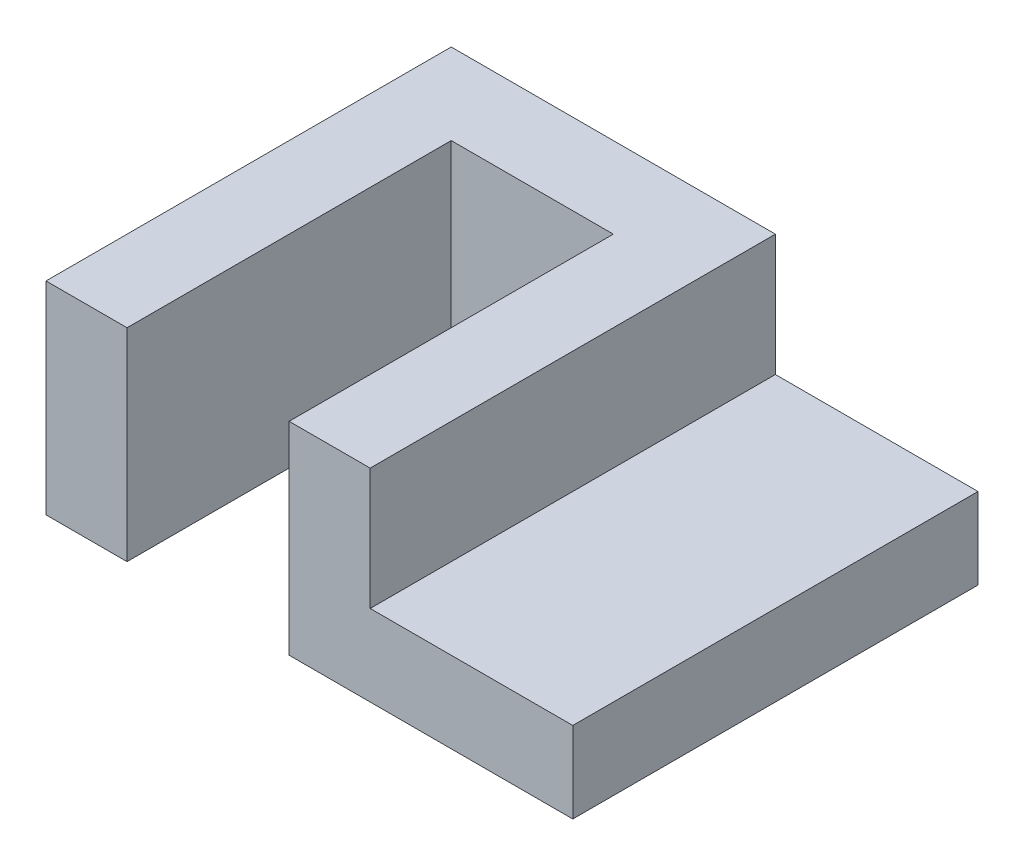
ISO-10303-21;
HEADER;
FILE_DESCRIPTION(('STEP AP214'),'2;1');
FILE_NAME('part.step','',(''),(''),'','','');
FILE_SCHEMA(('AUTOMOTIVE_DESIGN { 1 0 10303 214 1 1 1 1 }'));
ENDSEC;
DATA;
#1=APPLICATION_CONTEXT('core data for automotive mechanical design processes');
#2=APPLICATION_PROTOCOL_DEFINITION('international standard','automotive_design',2000,#1);
#3=PRODUCT_CONTEXT('',#1,'mechanical');
#4=PRODUCT('Part','Part','',(#3));
#5=PRODUCT_RELATED_PRODUCT_CATEGORY('part','',(#4));
#6=PRODUCT_DEFINITION_FORMATION('','',#4);
#7=PRODUCT_DEFINITION_CONTEXT('part definition',#1,'design');
#8=PRODUCT_DEFINITION('design','',#6,#7);
#9=PRODUCT_DEFINITION_SHAPE('','',#8);
#10=(LENGTH_UNIT() NAMED_UNIT(*) SI_UNIT(.MILLI.,.METRE.));
#11=(NAMED_UNIT(*) PLANE_ANGLE_UNIT() SI_UNIT($,.RADIAN.));
#12=(NAMED_UNIT(*) SI_UNIT($,.STERADIAN.) SOLID_ANGLE_UNIT());
#13=UNCERTAINTY_MEASURE_WITH_UNIT(LENGTH_MEASURE(1.E-05),#10,'distance_accuracy_value','');
#14=(GEOMETRIC_REPRESENTATION_CONTEXT(3) GLOBAL_UNCERTAINTY_ASSIGNED_CONTEXT((#13)) GLOBAL_UNIT_ASSIGNED_CONTEXT((#10,
#11,#12)) REPRESENTATION_CONTEXT('',''));
#15=CARTESIAN_POINT('',(0.,0.,0.));
#16=DIRECTION('',(0.,0.,1.));
#17=DIRECTION('',(1.,0.,0.));
#18=AXIS2_PLACEMENT_3D('',#15,#16,#17);
#19=CARTESIAN_POINT('',(80.,50.,-100.));
#20=DIRECTION('',(-1.,0.,0.));
#21=DIRECTION('',(0.,0.,1.));
#22=AXIS2_PLACEMENT_3D('',#19,#20,#21);
#23=PLANE('',#22);
#24=DIRECTION('',(0.,0.,1.));
#25=VECTOR('',#24,1.);
#26=CARTESIAN_POINT('',(80.,20.,0.));
#27=LINE('',#26,#25);
#28=CARTESIAN_POINT('',(80.,20.,-100.));
#29=VERTEX_POINT('',#28);
#30=CARTESIAN_POINT('',(80.,20.,0.));
#31=VERTEX_POINT('',#30);
#32=EDGE_CURVE('E59',#29,#31,#27,.T.);
#33=ORIENTED_EDGE('',*,*,#32,.F.);
#34=DIRECTION('',(0.,-1.,0.));
#35=VECTOR('',#34,1.);
#36=CARTESIAN_POINT('',(80.,50.,-100.));
#37=LINE('',#36,#35);
#38=CARTESIAN_POINT('',(80.,50.,-100.));
#39=VERTEX_POINT('',#38);
#40=EDGE_CURVE('E129',#39,#29,#37,.T.);
#41=ORIENTED_EDGE('',*,*,#40,.F.);
#42=DIRECTION('',(0.,0.,-1.));
#43=VECTOR('',#42,1.);
#44=CARTESIAN_POINT('',(80.,50.,-100.));
#45=LINE('',#44,#43);
#46=CARTESIAN_POINT('',(80.,50.,0.));
#47=VERTEX_POINT('',#46);
#48=EDGE_CURVE('E119',#47,#39,#45,.T.);
#49=ORIENTED_EDGE('',*,*,#48,.F.);
#50=DIRECTION('',(0.,-1.,0.));
#51=VECTOR('',#50,1.);
#52=CARTESIAN_POINT('',(80.,50.,0.));
#53=LINE('',#52,#51);
#54=EDGE_CURVE('E134',#47,#31,#53,.T.);
#55=ORIENTED_EDGE('',*,*,#54,.T.);
#56=EDGE_LOOP('',(#33,#41,#49,#55));
#57=FACE_BOUND('',#56,.T.);
#58=ADVANCED_FACE('F43',(#57),#23,.F.);
#59=CARTESIAN_POINT('',(20.,50.,0.));
#60=DIRECTION('',(0.,0.,-1.));
#61=DIRECTION('',(-1.,0.,0.));
#62=AXIS2_PLACEMENT_3D('',#59,#60,#61);
#63=PLANE('',#62);
#64=DIRECTION('',(1.,0.,0.));
#65=VECTOR('',#64,1.);
#66=CARTESIAN_POINT('',(20.,0.,0.));
#67=LINE('',#66,#65);
#68=CARTESIAN_POINT('',(0.,0.,0.));
#69=VERTEX_POINT('',#68);
#70=CARTESIAN_POINT('',(20.,0.,0.));
#71=VERTEX_POINT('',#70);
#72=EDGE_CURVE('E145',#69,#71,#67,.T.);
#73=ORIENTED_EDGE('',*,*,#72,.T.);
#74=DIRECTION('',(0.,-1.,0.));
#75=VECTOR('',#74,1.);
#76=CARTESIAN_POINT('',(20.,50.,0.));
#77=LINE('',#76,#75);
#78=CARTESIAN_POINT('',(20.,50.,0.));
#79=VERTEX_POINT('',#78);
#80=EDGE_CURVE('E11',#79,#71,#77,.T.);
#81=ORIENTED_EDGE('',*,*,#80,.F.);
#82=DIRECTION('',(1.,0.,0.));
#83=VECTOR('',#82,1.);
#84=CARTESIAN_POINT('',(20.,50.,0.));
#85=LINE('',#84,#83);
#86=CARTESIAN_POINT('',(0.,50.,0.));
#87=VERTEX_POINT('',#86);
#88=EDGE_CURVE('E168',#87,#79,#85,.T.);
#89=ORIENTED_EDGE('',*,*,#88,.F.);
#90=DIRECTION('',(0.,-1.,0.));
#91=VECTOR('',#90,1.);
#92=CARTESIAN_POINT('',(0.,50.,0.));
#93=LINE('',#92,#91);
#94=EDGE_CURVE('E141',#87,#69,#93,.T.);
#95=ORIENTED_EDGE('',*,*,#94,.T.);
#96=EDGE_LOOP('',(#73,#81,#89,#95));
#97=FACE_BOUND('',#96,.T.);
#98=ADVANCED_FACE('F45',(#97),#63,.F.);
#99=CARTESIAN_POINT('',(20.,50.,-80.));
#100=DIRECTION('',(-1.,0.,0.));
#101=DIRECTION('',(0.,0.,1.));
#102=AXIS2_PLACEMENT_3D('',#99,#100,#101);
#103=PLANE('',#102);
#104=DIRECTION('',(0.,0.,-1.));
#105=VECTOR('',#104,1.);
#106=CARTESIAN_POINT('',(20.,0.,-80.));
#107=LINE('',#106,#105);
#108=CARTESIAN_POINT('',(20.,0.,-80.));
#109=VERTEX_POINT('',#108);
#110=EDGE_CURVE('E149',#71,#109,#107,.T.);
#111=ORIENTED_EDGE('',*,*,#110,.T.);
#112=DIRECTION('',(0.,-1.,0.));
#113=VECTOR('',#112,1.);
#114=CARTESIAN_POINT('',(20.,50.,-80.));
#115=LINE('',#114,#113);
#116=CARTESIAN_POINT('',(20.,50.,-80.));
#117=VERTEX_POINT('',#116);
#118=EDGE_CURVE('E52',#117,#109,#115,.T.);
#119=ORIENTED_EDGE('',*,*,#118,.F.);
#120=DIRECTION('',(0.,0.,-1.));
#121=VECTOR('',#120,1.);
#122=CARTESIAN_POINT('',(20.,50.,-80.));
#123=LINE('',#122,#121);
#124=EDGE_CURVE('E103',#79,#117,#123,.T.);
#125=ORIENTED_EDGE('',*,*,#124,.F.);
#126=ORIENTED_EDGE('',*,*,#80,.T.);
#127=EDGE_LOOP('',(#111,#119,#125,#126));
#128=FACE_BOUND('',#127,.T.);
#129=ADVANCED_FACE('F253',(#128),#103,.F.);
#130=CARTESIAN_POINT('',(60.,50.,-80.));
#131=DIRECTION('',(0.,0.,-1.));
#132=DIRECTION('',(-1.,0.,0.));
#133=AXIS2_PLACEMENT_3D('',#130,#131,#132);
#134=PLANE('',#133);
#135=DIRECTION('',(1.,0.,0.));
#136=VECTOR('',#135,1.);
#137=CARTESIAN_POINT('',(60.,0.,-80.));
#138=LINE('',#137,#136);
#139=CARTESIAN_POINT('',(60.,0.,-80.));
#140=VERTEX_POINT('',#139);
#141=EDGE_CURVE('E153',#109,#140,#138,.T.);
#142=ORIENTED_EDGE('',*,*,#141,.T.);
#143=DIRECTION('',(0.,-1.,0.));
#144=VECTOR('',#143,1.);
#145=CARTESIAN_POINT('',(60.,50.,-80.));
#146=LINE('',#145,#144);
#147=CARTESIAN_POINT('',(60.,50.,-80.));
#148=VERTEX_POINT('',#147);
#149=EDGE_CURVE('E179',#148,#140,#146,.T.);
#150=ORIENTED_EDGE('',*,*,#149,.F.);
#151=DIRECTION('',(1.,0.,0.));
#152=VECTOR('',#151,1.);
#153=CARTESIAN_POINT('',(60.,50.,-80.));
#154=LINE('',#153,#152);
#155=EDGE_CURVE('E189',#117,#148,#154,.T.);
#156=ORIENTED_EDGE('',*,*,#155,.F.);
#157=ORIENTED_EDGE('',*,*,#118,.T.);
#158=EDGE_LOOP('',(#142,#150,#156,#157));
#159=FACE_BOUND('',#158,.T.);
#160=ADVANCED_FACE('F187',(#159),#134,.F.);
#161=CARTESIAN_POINT('',(60.,50.,0.));
#162=DIRECTION('',(1.,0.,0.));
#163=DIRECTION('',(0.,0.,-1.));
#164=AXIS2_PLACEMENT_3D('',#161,#162,#163);
#165=PLANE('',#164);
#166=DIRECTION('',(0.,0.,1.));
#167=VECTOR('',#166,1.);
#168=CARTESIAN_POINT('',(60.,0.,0.));
#169=LINE('',#168,#167);
#170=CARTESIAN_POINT('',(60.,0.,0.));
#171=VERTEX_POINT('',#170);
#172=EDGE_CURVE('E156',#140,#171,#169,.T.);
#173=ORIENTED_EDGE('',*,*,#172,.T.);
#174=DIRECTION('',(0.,-1.,0.));
#175=VECTOR('',#174,1.);
#176=CARTESIAN_POINT('',(60.,50.,0.));
#177=LINE('',#176,#175);
#178=CARTESIAN_POINT('',(60.,50.,0.));
#179=VERTEX_POINT('',#178);
#180=EDGE_CURVE('E175',#179,#171,#177,.T.);
#181=ORIENTED_EDGE('',*,*,#180,.F.);
#182=DIRECTION('',(0.,0.,1.));
#183=VECTOR('',#182,1.);
#184=CARTESIAN_POINT('',(60.,50.,0.));
#185=LINE('',#184,#183);
#186=EDGE_CURVE('E206',#148,#179,#185,.T.);
#187=ORIENTED_EDGE('',*,*,#186,.F.);
#188=ORIENTED_EDGE('',*,*,#149,.T.);
#189=EDGE_LOOP('',(#173,#181,#187,#188));
#190=FACE_BOUND('',#189,.T.);
#191=ADVANCED_FACE('F198',(#190),#165,.F.);
#192=CARTESIAN_POINT('',(80.,50.,0.));
#193=DIRECTION('',(0.,0.,-1.));
#194=DIRECTION('',(-1.,0.,0.));
#195=AXIS2_PLACEMENT_3D('',#192,#193,#194);
#196=PLANE('',#195);
#197=DIRECTION('',(1.,0.,0.));
#198=VECTOR('',#197,1.);
#199=CARTESIAN_POINT('',(80.,0.,0.));
#200=LINE('',#199,#198);
#201=CARTESIAN_POINT('',(130.,0.,0.));
#202=VERTEX_POINT('',#201);
#203=EDGE_CURVE('E159',#171,#202,#200,.T.);
#204=ORIENTED_EDGE('',*,*,#203,.T.);
#205=DIRECTION('',(0.,-1.,0.));
#206=VECTOR('',#205,1.);
#207=CARTESIAN_POINT('',(130.,0.,0.));
#208=LINE('',#207,#206);
#209=CARTESIAN_POINT('',(130.,20.,0.));
#210=VERTEX_POINT('',#209);
#211=EDGE_CURVE('E224',#210,#202,#208,.T.);
#212=ORIENTED_EDGE('',*,*,#211,.F.);
#213=DIRECTION('',(-1.,0.,0.));
#214=VECTOR('',#213,1.);
#215=CARTESIAN_POINT('',(130.,20.,0.));
#216=LINE('',#215,#214);
#217=EDGE_CURVE('E218',#210,#31,#216,.T.);
#218=ORIENTED_EDGE('',*,*,#217,.T.);
#219=ORIENTED_EDGE('',*,*,#54,.F.);
#220=DIRECTION('',(1.,0.,0.));
#221=VECTOR('',#220,1.);
#222=CARTESIAN_POINT('',(80.,50.,0.));
#223=LINE('',#222,#221);
#224=EDGE_CURVE('E125',#179,#47,#223,.T.);
#225=ORIENTED_EDGE('',*,*,#224,.F.);
#226=ORIENTED_EDGE('',*,*,#180,.T.);
#227=EDGE_LOOP('',(#204,#212,#218,#219,#225,#226));
#228=FACE_BOUND('',#227,.T.);
#229=ADVANCED_FACE('F201',(#228),#196,.F.);
#230=CARTESIAN_POINT('',(0.,50.,-100.));
#231=DIRECTION('',(0.,0.,1.));
#232=DIRECTION('',(1.,0.,0.));
#233=AXIS2_PLACEMENT_3D('',#230,#231,#232);
#234=PLANE('',#233);
#235=DIRECTION('',(-1.,0.,0.));
#236=VECTOR('',#235,1.);
#237=CARTESIAN_POINT('',(0.,0.,-100.));
#238=LINE('',#237,#236);
#239=CARTESIAN_POINT('',(130.,0.,-100.));
#240=VERTEX_POINT('',#239);
#241=CARTESIAN_POINT('',(0.,0.,-100.));
#242=VERTEX_POINT('',#241);
#243=EDGE_CURVE('E163',#240,#242,#238,.T.);
#244=ORIENTED_EDGE('',*,*,#243,.T.);
#245=DIRECTION('',(0.,-1.,0.));
#246=VECTOR('',#245,1.);
#247=CARTESIAN_POINT('',(0.,50.,-100.));
#248=LINE('',#247,#246);
#249=CARTESIAN_POINT('',(0.,50.,-100.));
#250=VERTEX_POINT('',#249);
#251=EDGE_CURVE('E135',#250,#242,#248,.T.);
#252=ORIENTED_EDGE('',*,*,#251,.F.);
#253=DIRECTION('',(-1.,0.,0.));
#254=VECTOR('',#253,1.);
#255=CARTESIAN_POINT('',(0.,50.,-100.));
#256=LINE('',#255,#254);
#257=EDGE_CURVE('E122',#39,#250,#256,.T.);
#258=ORIENTED_EDGE('',*,*,#257,.F.);
#259=ORIENTED_EDGE('',*,*,#40,.T.);
#260=DIRECTION('',(-1.,0.,0.));
#261=VECTOR('',#260,1.);
#262=CARTESIAN_POINT('',(130.,20.,-100.));
#263=LINE('',#262,#261);
#264=CARTESIAN_POINT('',(130.,20.,-100.));
#265=VERTEX_POINT('',#264);
#266=EDGE_CURVE('E150',#265,#29,#263,.T.);
#267=ORIENTED_EDGE('',*,*,#266,.F.);
#268=DIRECTION('',(0.,1.,0.));
#269=VECTOR('',#268,1.);
#270=CARTESIAN_POINT('',(130.,0.,-100.));
#271=LINE('',#270,#269);
#272=EDGE_CURVE('E228',#240,#265,#271,.T.);
#273=ORIENTED_EDGE('',*,*,#272,.F.);
#274=EDGE_LOOP('',(#244,#252,#258,#259,#267,#273));
#275=FACE_BOUND('',#274,.T.);
#276=ADVANCED_FACE('F137',(#275),#234,.F.);
#277=CARTESIAN_POINT('',(0.,50.,0.));
#278=DIRECTION('',(1.,0.,0.));
#279=DIRECTION('',(0.,0.,-1.));
#280=AXIS2_PLACEMENT_3D('',#277,#278,#279);
#281=PLANE('',#280);
#282=DIRECTION('',(0.,0.,1.));
#283=VECTOR('',#282,1.);
#284=CARTESIAN_POINT('',(0.,0.,0.));
#285=LINE('',#284,#283);
#286=EDGE_CURVE('E95',#242,#69,#285,.T.);
#287=ORIENTED_EDGE('',*,*,#286,.T.);
#288=ORIENTED_EDGE('',*,*,#94,.F.);
#289=DIRECTION('',(0.,0.,1.));
#290=VECTOR('',#289,1.);
#291=CARTESIAN_POINT('',(0.,50.,0.));
#292=LINE('',#291,#290);
#293=EDGE_CURVE('E68',#250,#87,#292,.T.);
#294=ORIENTED_EDGE('',*,*,#293,.F.);
#295=ORIENTED_EDGE('',*,*,#251,.T.);
#296=EDGE_LOOP('',(#287,#288,#294,#295));
#297=FACE_BOUND('',#296,.T.);
#298=ADVANCED_FACE('F249',(#297),#281,.F.);
#299=CARTESIAN_POINT('',(0.,50.,0.));
#300=DIRECTION('',(0.,-1.,0.));
#301=DIRECTION('',(0.,0.,-1.));
#302=AXIS2_PLACEMENT_3D('',#299,#300,#301);
#303=PLANE('',#302);
#304=ORIENTED_EDGE('',*,*,#88,.T.);
#305=ORIENTED_EDGE('',*,*,#124,.T.);
#306=ORIENTED_EDGE('',*,*,#155,.T.);
#307=ORIENTED_EDGE('',*,*,#186,.T.);
#308=ORIENTED_EDGE('',*,*,#224,.T.);
#309=ORIENTED_EDGE('',*,*,#48,.T.);
#310=ORIENTED_EDGE('',*,*,#257,.T.);
#311=ORIENTED_EDGE('',*,*,#293,.T.);
#312=EDGE_LOOP('',(#304,#305,#306,#307,#308,#309,#310,#311));
#313=FACE_BOUND('',#312,.T.);
#314=ADVANCED_FACE('F120',(#313),#303,.F.);
#315=CARTESIAN_POINT('',(0.,0.,0.));
#316=DIRECTION('',(0.,-1.,0.));
#317=DIRECTION('',(0.,0.,-1.));
#318=AXIS2_PLACEMENT_3D('',#315,#316,#317);
#319=PLANE('',#318);
#320=ORIENTED_EDGE('',*,*,#72,.F.);
#321=ORIENTED_EDGE('',*,*,#286,.F.);
#322=ORIENTED_EDGE('',*,*,#243,.F.);
#323=DIRECTION('',(0.,0.,-1.));
#324=VECTOR('',#323,1.);
#325=CARTESIAN_POINT('',(130.,0.,0.));
#326=LINE('',#325,#324);
#327=EDGE_CURVE('E232',#202,#240,#326,.T.);
#328=ORIENTED_EDGE('',*,*,#327,.F.);
#329=ORIENTED_EDGE('',*,*,#203,.F.);
#330=ORIENTED_EDGE('',*,*,#172,.F.);
#331=ORIENTED_EDGE('',*,*,#141,.F.);
#332=ORIENTED_EDGE('',*,*,#110,.F.);
#333=EDGE_LOOP('',(#320,#321,#322,#328,#329,#330,#331,#332));
#334=FACE_BOUND('',#333,.T.);
#335=ADVANCED_FACE('F193',(#334),#319,.T.);
#336=CARTESIAN_POINT('',(130.,20.,0.));
#337=DIRECTION('',(0.,-1.,0.));
#338=DIRECTION('',(0.,0.,-1.));
#339=AXIS2_PLACEMENT_3D('',#336,#337,#338);
#340=PLANE('',#339);
#341=ORIENTED_EDGE('',*,*,#32,.T.);
#342=ORIENTED_EDGE('',*,*,#217,.F.);
#343=DIRECTION('',(0.,0.,1.));
#344=VECTOR('',#343,1.);
#345=CARTESIAN_POINT('',(130.,20.,0.));
#346=LINE('',#345,#344);
#347=EDGE_CURVE('E221',#265,#210,#346,.T.);
#348=ORIENTED_EDGE('',*,*,#347,.F.);
#349=ORIENTED_EDGE('',*,*,#266,.T.);
#350=EDGE_LOOP('',(#341,#342,#348,#349));
#351=FACE_BOUND('',#350,.T.);
#352=ADVANCED_FACE('F300',(#351),#340,.F.);
#353=CARTESIAN_POINT('',(130.,0.,0.));
#354=DIRECTION('',(-1.,0.,0.));
#355=DIRECTION('',(0.,0.,1.));
#356=AXIS2_PLACEMENT_3D('',#353,#354,#355);
#357=PLANE('',#356);
#358=ORIENTED_EDGE('',*,*,#211,.T.);
#359=ORIENTED_EDGE('',*,*,#327,.T.);
#360=ORIENTED_EDGE('',*,*,#272,.T.);
#361=ORIENTED_EDGE('',*,*,#347,.T.);
#362=EDGE_LOOP('',(#358,#359,#360,#361));
#363=FACE_BOUND('',#362,.T.);
#364=ADVANCED_FACE('F239',(#363),#357,.F.);
#365=CLOSED_SHELL('',(#58,#98,#129,#160,#191,#229,#276,#298,#314,#335,#352,#364));
#366=MANIFOLD_SOLID_BREP('B2',#365);
#367=ADVANCED_BREP_SHAPE_REPRESENTATION('',(#18,#366),#14);
#368=SHAPE_DEFINITION_REPRESENTATION(#9,#367);
ENDSEC;
END-ISO-10303-21;
